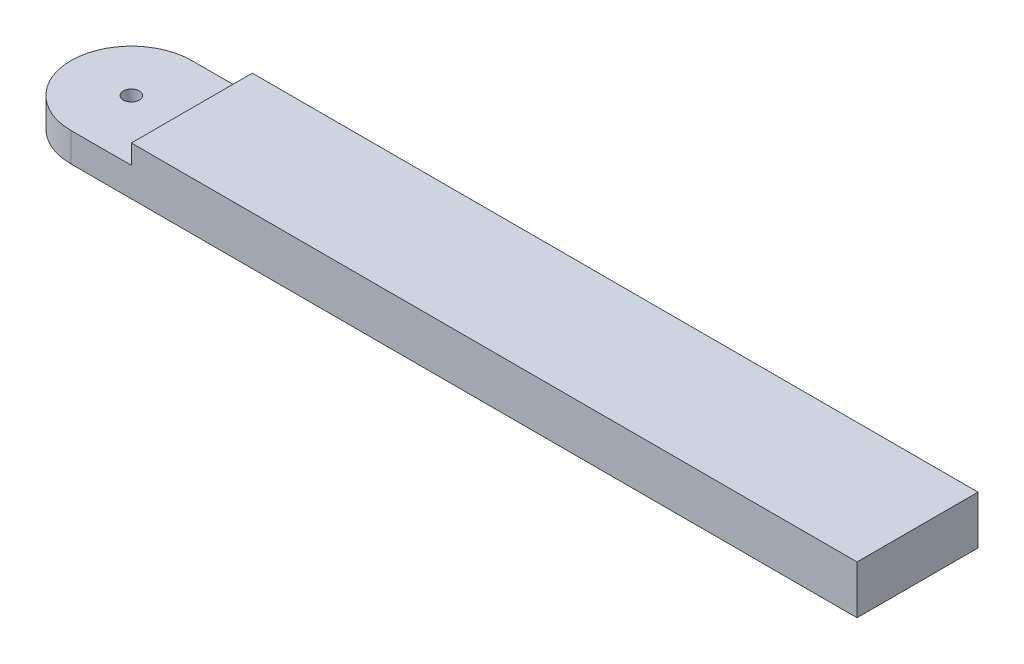
ISO-10303-21;
HEADER;
FILE_DESCRIPTION(('STEP AP214'),'2;1');
FILE_NAME('part.step','',(''),(''),'','','');
FILE_SCHEMA(('AUTOMOTIVE_DESIGN { 1 0 10303 214 1 1 1 1 }'));
ENDSEC;
DATA;
#1=APPLICATION_CONTEXT('core data for automotive mechanical design processes');
#2=APPLICATION_PROTOCOL_DEFINITION('international standard','automotive_design',2000,#1);
#3=PRODUCT_CONTEXT('',#1,'mechanical');
#4=PRODUCT('Part','Part','',(#3));
#5=PRODUCT_RELATED_PRODUCT_CATEGORY('part','',(#4));
#6=PRODUCT_DEFINITION_FORMATION('','',#4);
#7=PRODUCT_DEFINITION_CONTEXT('part definition',#1,'design');
#8=PRODUCT_DEFINITION('design','',#6,#7);
#9=PRODUCT_DEFINITION_SHAPE('','',#8);
#10=(LENGTH_UNIT() NAMED_UNIT(*) SI_UNIT(.MILLI.,.METRE.));
#11=(NAMED_UNIT(*) PLANE_ANGLE_UNIT() SI_UNIT($,.RADIAN.));
#12=(NAMED_UNIT(*) SI_UNIT($,.STERADIAN.) SOLID_ANGLE_UNIT());
#13=UNCERTAINTY_MEASURE_WITH_UNIT(LENGTH_MEASURE(1.E-05),#10,'distance_accuracy_value','');
#14=(GEOMETRIC_REPRESENTATION_CONTEXT(3) GLOBAL_UNCERTAINTY_ASSIGNED_CONTEXT((#13)) GLOBAL_UNIT_ASSIGNED_CONTEXT((#10,
#11,#12)) REPRESENTATION_CONTEXT('',''));
#15=CARTESIAN_POINT('',(0.,0.,0.));
#16=DIRECTION('',(0.,0.,1.));
#17=DIRECTION('',(1.,0.,0.));
#18=AXIS2_PLACEMENT_3D('',#15,#16,#17);
#19=CARTESIAN_POINT('',(-41.5478175164817,10.,2.06430698235728));
#20=DIRECTION('',(0.,-1.,0.));
#21=DIRECTION('',(0.,0.,-1.));
#22=AXIS2_PLACEMENT_3D('',#19,#20,#21);
#23=CYLINDRICAL_SURFACE('',#22,12.5);
#24=CARTESIAN_POINT('',(-41.5478175164817,6.,2.06430698235728));
#25=DIRECTION('',(0.,1.,0.));
#26=DIRECTION('',(0.,0.,1.));
#27=AXIS2_PLACEMENT_3D('',#24,#25,#26);
#28=CIRCLE('',#27,12.5);
#29=CARTESIAN_POINT('',(-41.5478175164817,6.,-10.4356930176427));
#30=VERTEX_POINT('',#29);
#31=CARTESIAN_POINT('',(-41.5478175164817,6.,14.5643069823573));
#32=VERTEX_POINT('',#31);
#33=EDGE_CURVE('E49',#30,#32,#28,.T.);
#34=ORIENTED_EDGE('',*,*,#33,.F.);
#35=DIRECTION('',(0.,-1.,0.));
#36=VECTOR('',#35,1.);
#37=CARTESIAN_POINT('',(-41.5478175164817,10.,-10.4356930176427));
#38=LINE('',#37,#36);
#39=CARTESIAN_POINT('',(-41.5478175164817,0.,-10.4356930176427));
#40=VERTEX_POINT('',#39);
#41=EDGE_CURVE('E42',#30,#40,#38,.T.);
#42=ORIENTED_EDGE('',*,*,#41,.T.);
#43=CARTESIAN_POINT('',(-41.5478175164817,0.,2.06430698235728));
#44=DIRECTION('',(0.,1.,0.));
#45=DIRECTION('',(0.,0.,1.));
#46=AXIS2_PLACEMENT_3D('',#43,#44,#45);
#47=CIRCLE('',#46,12.5);
#48=CARTESIAN_POINT('',(-41.5478175164817,0.,14.5643069823573));
#49=VERTEX_POINT('',#48);
#50=EDGE_CURVE('E89',#40,#49,#47,.T.);
#51=ORIENTED_EDGE('',*,*,#50,.T.);
#52=DIRECTION('',(0.,-1.,0.));
#53=VECTOR('',#52,1.);
#54=CARTESIAN_POINT('',(-41.5478175164817,10.,14.5643069823573));
#55=LINE('',#54,#53);
#56=EDGE_CURVE('E83',#32,#49,#55,.T.);
#57=ORIENTED_EDGE('',*,*,#56,.F.);
#58=EDGE_LOOP('',(#34,#42,#51,#57));
#59=FACE_BOUND('',#58,.T.);
#60=ADVANCED_FACE('F33',(#59),#23,.T.);
#61=CARTESIAN_POINT('',(-41.5478175164817,10.,2.06430698235728));
#62=DIRECTION('',(0.,-1.,0.));
#63=DIRECTION('',(0.,0.,-1.));
#64=AXIS2_PLACEMENT_3D('',#61,#62,#63);
#65=CYLINDRICAL_SURFACE('',#64,1.65);
#66=CARTESIAN_POINT('',(-41.5478175164817,0.,2.06430698235728));
#67=DIRECTION('',(0.,1.,0.));
#68=DIRECTION('',(0.,0.,1.));
#69=AXIS2_PLACEMENT_3D('',#66,#67,#68);
#70=CIRCLE('',#69,1.65);
#71=CARTESIAN_POINT('',(-41.5478175164817,0.,3.71430698235728));
#72=VERTEX_POINT('',#71);
#73=EDGE_CURVE('E100',#72,#72,#70,.T.);
#74=ORIENTED_EDGE('',*,*,#73,.F.);
#75=EDGE_LOOP('',(#74));
#76=FACE_BOUND('',#75,.T.);
#77=CARTESIAN_POINT('',(-41.5478175164817,6.,2.06430698235728));
#78=DIRECTION('',(0.,1.,0.));
#79=DIRECTION('',(0.,0.,1.));
#80=AXIS2_PLACEMENT_3D('',#77,#78,#79);
#81=CIRCLE('',#80,1.65);
#82=CARTESIAN_POINT('',(-41.5478175164817,6.,3.71430698235728));
#83=VERTEX_POINT('',#82);
#84=EDGE_CURVE('E37',#83,#83,#81,.T.);
#85=ORIENTED_EDGE('',*,*,#84,.T.);
#86=EDGE_LOOP('',(#85));
#87=FACE_BOUND('',#86,.T.);
#88=ADVANCED_FACE('F161',(#76,#87),#65,.F.);
#89=CARTESIAN_POINT('',(-41.5478175164817,10.,2.06430698235728));
#90=DIRECTION('',(0.,1.,0.));
#91=DIRECTION('',(0.,0.,1.));
#92=AXIS2_PLACEMENT_3D('',#89,#90,#91);
#93=PLANE('',#92);
#94=DIRECTION('',(0.,0.,-1.));
#95=VECTOR('',#94,1.);
#96=CARTESIAN_POINT('',(-29.0478175164817,10.,14.5643069823573));
#97=LINE('',#96,#95);
#98=CARTESIAN_POINT('',(-29.0478175164817,10.,14.5643069823573));
#99=VERTEX_POINT('',#98);
#100=CARTESIAN_POINT('',(-29.0478175164817,10.,-10.4356930176427));
#101=VERTEX_POINT('',#100);
#102=EDGE_CURVE('E132',#99,#101,#97,.T.);
#103=ORIENTED_EDGE('',*,*,#102,.F.);
#104=DIRECTION('',(1.,0.,0.));
#105=VECTOR('',#104,1.);
#106=CARTESIAN_POINT('',(-41.5478175164817,10.,14.5643069823573));
#107=LINE('',#106,#105);
#108=CARTESIAN_POINT('',(120.952182483518,10.,14.5643069823573));
#109=VERTEX_POINT('',#108);
#110=EDGE_CURVE('E58',#99,#109,#107,.T.);
#111=ORIENTED_EDGE('',*,*,#110,.T.);
#112=DIRECTION('',(0.,0.,-1.));
#113=VECTOR('',#112,1.);
#114=CARTESIAN_POINT('',(120.952182483518,10.,-10.4356930176427));
#115=LINE('',#114,#113);
#116=CARTESIAN_POINT('',(120.952182483518,10.,-10.4356930176427));
#117=VERTEX_POINT('',#116);
#118=EDGE_CURVE('E88',#109,#117,#115,.T.);
#119=ORIENTED_EDGE('',*,*,#118,.T.);
#120=DIRECTION('',(-1.,0.,0.));
#121=VECTOR('',#120,1.);
#122=CARTESIAN_POINT('',(-41.5478175164817,10.,-10.4356930176427));
#123=LINE('',#122,#121);
#124=EDGE_CURVE('E118',#117,#101,#123,.T.);
#125=ORIENTED_EDGE('',*,*,#124,.T.);
#126=EDGE_LOOP('',(#103,#111,#119,#125));
#127=FACE_BOUND('',#126,.T.);
#128=ADVANCED_FACE('F121',(#127),#93,.T.);
#129=CARTESIAN_POINT('',(-41.5478175164817,0.,2.06430698235728));
#130=DIRECTION('',(0.,1.,0.));
#131=DIRECTION('',(0.,0.,1.));
#132=AXIS2_PLACEMENT_3D('',#129,#130,#131);
#133=PLANE('',#132);
#134=DIRECTION('',(0.,0.,-1.));
#135=VECTOR('',#134,1.);
#136=CARTESIAN_POINT('',(120.952182483518,0.,-10.4356930176427));
#137=LINE('',#136,#135);
#138=CARTESIAN_POINT('',(120.952182483518,0.,14.5643069823573));
#139=VERTEX_POINT('',#138);
#140=CARTESIAN_POINT('',(120.952182483518,0.,-10.4356930176427));
#141=VERTEX_POINT('',#140);
#142=EDGE_CURVE('E94',#139,#141,#137,.T.);
#143=ORIENTED_EDGE('',*,*,#142,.F.);
#144=DIRECTION('',(1.,0.,0.));
#145=VECTOR('',#144,1.);
#146=CARTESIAN_POINT('',(-41.5478175164817,0.,14.5643069823573));
#147=LINE('',#146,#145);
#148=EDGE_CURVE('E77',#49,#139,#147,.T.);
#149=ORIENTED_EDGE('',*,*,#148,.F.);
#150=ORIENTED_EDGE('',*,*,#50,.F.);
#151=DIRECTION('',(-1.,0.,0.));
#152=VECTOR('',#151,1.);
#153=CARTESIAN_POINT('',(-41.5478175164817,0.,-10.4356930176427));
#154=LINE('',#153,#152);
#155=EDGE_CURVE('E99',#141,#40,#154,.T.);
#156=ORIENTED_EDGE('',*,*,#155,.F.);
#157=EDGE_LOOP('',(#143,#149,#150,#156));
#158=FACE_BOUND('',#157,.T.);
#159=ORIENTED_EDGE('',*,*,#73,.T.);
#160=EDGE_LOOP('',(#159));
#161=FACE_BOUND('',#160,.T.);
#162=ADVANCED_FACE('F96',(#158,#161),#133,.F.);
#163=CARTESIAN_POINT('',(120.952182483518,10.,-10.4356930176427));
#164=DIRECTION('',(-1.,0.,0.));
#165=DIRECTION('',(0.,0.,1.));
#166=AXIS2_PLACEMENT_3D('',#163,#164,#165);
#167=PLANE('',#166);
#168=ORIENTED_EDGE('',*,*,#142,.T.);
#169=DIRECTION('',(0.,-1.,0.));
#170=VECTOR('',#169,1.);
#171=CARTESIAN_POINT('',(120.952182483518,10.,-10.4356930176427));
#172=LINE('',#171,#170);
#173=EDGE_CURVE('E11',#117,#141,#172,.T.);
#174=ORIENTED_EDGE('',*,*,#173,.F.);
#175=ORIENTED_EDGE('',*,*,#118,.F.);
#176=DIRECTION('',(0.,-1.,0.));
#177=VECTOR('',#176,1.);
#178=CARTESIAN_POINT('',(120.952182483518,10.,14.5643069823573));
#179=LINE('',#178,#177);
#180=EDGE_CURVE('E80',#109,#139,#179,.T.);
#181=ORIENTED_EDGE('',*,*,#180,.T.);
#182=EDGE_LOOP('',(#168,#174,#175,#181));
#183=FACE_BOUND('',#182,.T.);
#184=ADVANCED_FACE('F35',(#183),#167,.F.);
#185=CARTESIAN_POINT('',(-41.5478175164817,10.,-10.4356930176427));
#186=DIRECTION('',(0.,0.,1.));
#187=DIRECTION('',(1.,0.,0.));
#188=AXIS2_PLACEMENT_3D('',#185,#186,#187);
#189=PLANE('',#188);
#190=DIRECTION('',(-1.,0.,0.));
#191=VECTOR('',#190,1.);
#192=CARTESIAN_POINT('',(-41.5478175164817,6.,-10.4356930176427));
#193=LINE('',#192,#191);
#194=CARTESIAN_POINT('',(-29.0478175164817,6.,-10.4356930176427));
#195=VERTEX_POINT('',#194);
#196=EDGE_CURVE('E125',#195,#30,#193,.T.);
#197=ORIENTED_EDGE('',*,*,#196,.F.);
#198=DIRECTION('',(0.,1.,0.));
#199=VECTOR('',#198,1.);
#200=CARTESIAN_POINT('',(-29.0478175164817,10.,-10.4356930176427));
#201=LINE('',#200,#199);
#202=EDGE_CURVE('E104',#195,#101,#201,.T.);
#203=ORIENTED_EDGE('',*,*,#202,.T.);
#204=ORIENTED_EDGE('',*,*,#124,.F.);
#205=ORIENTED_EDGE('',*,*,#173,.T.);
#206=ORIENTED_EDGE('',*,*,#155,.T.);
#207=ORIENTED_EDGE('',*,*,#41,.F.);
#208=EDGE_LOOP('',(#197,#203,#204,#205,#206,#207));
#209=FACE_BOUND('',#208,.T.);
#210=ADVANCED_FACE('F115',(#209),#189,.F.);
#211=CARTESIAN_POINT('',(-41.5478175164817,10.,14.5643069823573));
#212=DIRECTION('',(0.,0.,-1.));
#213=DIRECTION('',(-1.,0.,0.));
#214=AXIS2_PLACEMENT_3D('',#211,#212,#213);
#215=PLANE('',#214);
#216=ORIENTED_EDGE('',*,*,#110,.F.);
#217=DIRECTION('',(0.,1.,0.));
#218=VECTOR('',#217,1.);
#219=CARTESIAN_POINT('',(-29.0478175164817,6.,14.5643069823573));
#220=LINE('',#219,#218);
#221=CARTESIAN_POINT('',(-29.0478175164817,6.,14.5643069823573));
#222=VERTEX_POINT('',#221);
#223=EDGE_CURVE('E128',#222,#99,#220,.T.);
#224=ORIENTED_EDGE('',*,*,#223,.F.);
#225=DIRECTION('',(1.,0.,0.));
#226=VECTOR('',#225,1.);
#227=CARTESIAN_POINT('',(-29.0478175164817,6.,14.5643069823573));
#228=LINE('',#227,#226);
#229=EDGE_CURVE('E131',#32,#222,#228,.T.);
#230=ORIENTED_EDGE('',*,*,#229,.F.);
#231=ORIENTED_EDGE('',*,*,#56,.T.);
#232=ORIENTED_EDGE('',*,*,#148,.T.);
#233=ORIENTED_EDGE('',*,*,#180,.F.);
#234=EDGE_LOOP('',(#216,#224,#230,#231,#232,#233));
#235=FACE_BOUND('',#234,.T.);
#236=ADVANCED_FACE('F79',(#235),#215,.F.);
#237=CARTESIAN_POINT('',(-29.0478175164817,6.,14.5643069823573));
#238=DIRECTION('',(1.,0.,0.));
#239=DIRECTION('',(0.,0.,-1.));
#240=AXIS2_PLACEMENT_3D('',#237,#238,#239);
#241=PLANE('',#240);
#242=DIRECTION('',(0.,0.,-1.));
#243=VECTOR('',#242,1.);
#244=CARTESIAN_POINT('',(-29.0478175164817,6.,14.5643069823573));
#245=LINE('',#244,#243);
#246=EDGE_CURVE('E135',#222,#195,#245,.T.);
#247=ORIENTED_EDGE('',*,*,#246,.F.);
#248=ORIENTED_EDGE('',*,*,#223,.T.);
#249=ORIENTED_EDGE('',*,*,#102,.T.);
#250=ORIENTED_EDGE('',*,*,#202,.F.);
#251=EDGE_LOOP('',(#247,#248,#249,#250));
#252=FACE_BOUND('',#251,.T.);
#253=ADVANCED_FACE('F145',(#252),#241,.F.);
#254=CARTESIAN_POINT('',(0.,6.,0.));
#255=DIRECTION('',(0.,1.,0.));
#256=DIRECTION('',(0.,0.,1.));
#257=AXIS2_PLACEMENT_3D('',#254,#255,#256);
#258=PLANE('',#257);
#259=ORIENTED_EDGE('',*,*,#84,.F.);
#260=EDGE_LOOP('',(#259));
#261=FACE_BOUND('',#260,.T.);
#262=ORIENTED_EDGE('',*,*,#196,.T.);
#263=ORIENTED_EDGE('',*,*,#33,.T.);
#264=ORIENTED_EDGE('',*,*,#229,.T.);
#265=ORIENTED_EDGE('',*,*,#246,.T.);
#266=EDGE_LOOP('',(#262,#263,#264,#265));
#267=FACE_BOUND('',#266,.T.);
#268=ADVANCED_FACE('F140',(#261,#267),#258,.T.);
#269=CLOSED_SHELL('',(#60,#88,#128,#162,#184,#210,#236,#253,#268));
#270=MANIFOLD_SOLID_BREP('B2',#269);
#271=ADVANCED_BREP_SHAPE_REPRESENTATION('',(#18,#270),#14);
#272=SHAPE_DEFINITION_REPRESENTATION(#9,#271);
ENDSEC;
END-ISO-10303-21;
